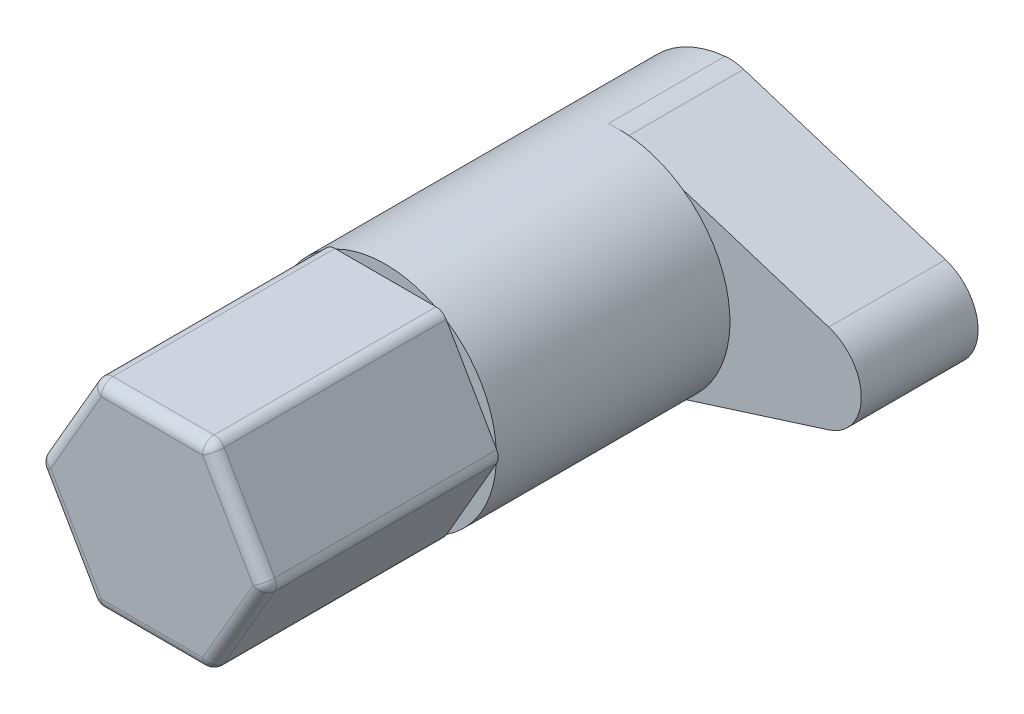
ISO-10303-21;
HEADER;
FILE_DESCRIPTION(('STEP AP214'),'2;1');
FILE_NAME('part.step','',(''),(''),'','','');
FILE_SCHEMA(('AUTOMOTIVE_DESIGN { 1 0 10303 214 1 1 1 1 }'));
ENDSEC;
DATA;
#1=APPLICATION_CONTEXT('core data for automotive mechanical design processes');
#2=APPLICATION_PROTOCOL_DEFINITION('international standard','automotive_design',2000,#1);
#3=PRODUCT_CONTEXT('',#1,'mechanical');
#4=PRODUCT('Part','Part','',(#3));
#5=PRODUCT_RELATED_PRODUCT_CATEGORY('part','',(#4));
#6=PRODUCT_DEFINITION_FORMATION('','',#4);
#7=PRODUCT_DEFINITION_CONTEXT('part definition',#1,'design');
#8=PRODUCT_DEFINITION('design','',#6,#7);
#9=PRODUCT_DEFINITION_SHAPE('','',#8);
#10=(LENGTH_UNIT() NAMED_UNIT(*) SI_UNIT(.MILLI.,.METRE.));
#11=(NAMED_UNIT(*) PLANE_ANGLE_UNIT() SI_UNIT($,.RADIAN.));
#12=(NAMED_UNIT(*) SI_UNIT($,.STERADIAN.) SOLID_ANGLE_UNIT());
#13=UNCERTAINTY_MEASURE_WITH_UNIT(LENGTH_MEASURE(1.E-05),#10,'distance_accuracy_value','');
#14=(GEOMETRIC_REPRESENTATION_CONTEXT(3) GLOBAL_UNCERTAINTY_ASSIGNED_CONTEXT((#13)) GLOBAL_UNIT_ASSIGNED_CONTEXT((#10,
#11,#12)) REPRESENTATION_CONTEXT('',''));
#15=CARTESIAN_POINT('',(0.,0.,0.));
#16=DIRECTION('',(0.,0.,1.));
#17=DIRECTION('',(1.,0.,0.));
#18=AXIS2_PLACEMENT_3D('',#15,#16,#17);
#19=CARTESIAN_POINT('',(0.,0.,-10.));
#20=DIRECTION('',(0.,0.,-1.));
#21=DIRECTION('',(-1.,0.,0.));
#22=AXIS2_PLACEMENT_3D('',#19,#20,#21);
#23=PLANE('',#22);
#24=DIRECTION('',(-0.953342225350744,-0.301891704694402,0.));
#25=VECTOR('',#24,1.);
#26=CARTESIAN_POINT('',(15.,0.,-10.));
#27=LINE('',#26,#25);
#28=CARTESIAN_POINT('',(2.73415804089876,-3.88418328704872,-10.));
#29=VERTEX_POINT('',#28);
#30=CARTESIAN_POINT('',(0.335962396600342,-4.64361190774323,-10.));
#31=VERTEX_POINT('',#30);
#32=EDGE_CURVE('E271',#29,#31,#27,.T.);
#33=ORIENTED_EDGE('',*,*,#32,.F.);
#34=CARTESIAN_POINT('',(0.,0.,-10.));
#35=DIRECTION('',(0.,0.,-1.));
#36=DIRECTION('',(-1.,0.,0.));
#37=AXIS2_PLACEMENT_3D('',#34,#35,#36);
#38=CIRCLE('',#37,4.75);
#39=CARTESIAN_POINT('',(-0.462599931180075,-4.72742015307209,-10.));
#40=VERTEX_POINT('',#39);
#41=EDGE_CURVE('E254',#29,#40,#38,.T.);
#42=ORIENTED_EDGE('',*,*,#41,.T.);
#43=CARTESIAN_POINT('',(-0.267821012788464,-2.73692745704174,-10.));
#44=DIRECTION('',(0.,0.,-1.));
#45=DIRECTION('',(-1.,0.,0.));
#46=AXIS2_PLACEMENT_3D('',#43,#44,#45);
#47=CIRCLE('',#46,2.);
#48=EDGE_CURVE('E11',#40,#31,#47,.F.);
#49=ORIENTED_EDGE('',*,*,#48,.T.);
#50=EDGE_LOOP('',(#33,#42,#49));
#51=FACE_BOUND('',#50,.T.);
#52=ADVANCED_FACE('F45',(#51),#23,.T.);
#53=CARTESIAN_POINT('',(0.,0.,0.));
#54=DIRECTION('',(0.,0.,1.));
#55=DIRECTION('',(1.,0.,0.));
#56=AXIS2_PLACEMENT_3D('',#53,#54,#55);
#57=PLANE('',#56);
#58=CARTESIAN_POINT('',(0.,0.,0.));
#59=DIRECTION('',(0.,0.,-1.));
#60=DIRECTION('',(-1.,0.,0.));
#61=AXIS2_PLACEMENT_3D('',#58,#59,#60);
#62=CIRCLE('',#61,4.75);
#63=CARTESIAN_POINT('',(-2.61994779430404,3.96211730708738,0.));
#64=VERTEX_POINT('',#63);
#65=CARTESIAN_POINT('',(-2.12132034355964,4.25,0.));
#66=VERTEX_POINT('',#65);
#67=EDGE_CURVE('E513',#64,#66,#62,.T.);
#68=ORIENTED_EDGE('',*,*,#67,.F.);
#69=DIRECTION('',(-0.5,-0.866025403784439,0.));
#70=VECTOR('',#69,1.);
#71=CARTESIAN_POINT('',(-2.45373864405591,4.25,0.));
#72=LINE('',#71,#70);
#73=CARTESIAN_POINT('',(-2.59807621135332,4.,0.));
#74=VERTEX_POINT('',#73);
#75=EDGE_CURVE('E305',#74,#64,#72,.T.);
#76=ORIENTED_EDGE('',*,*,#75,.F.);
#77=CARTESIAN_POINT('',(-2.1650635094611,3.75,0.));
#78=DIRECTION('',(0.,0.,1.));
#79=DIRECTION('',(1.,0.,0.));
#80=AXIS2_PLACEMENT_3D('',#77,#78,#79);
#81=CIRCLE('',#80,0.5);
#82=CARTESIAN_POINT('',(-2.1650635094611,4.25,0.));
#83=VERTEX_POINT('',#82);
#84=EDGE_CURVE('E390',#74,#83,#81,.F.);
#85=ORIENTED_EDGE('',*,*,#84,.T.);
#86=DIRECTION('',(-1.,0.,0.));
#87=VECTOR('',#86,1.);
#88=CARTESIAN_POINT('',(2.45373864405591,4.25,0.));
#89=LINE('',#88,#87);
#90=EDGE_CURVE('E297',#66,#83,#89,.T.);
#91=ORIENTED_EDGE('',*,*,#90,.F.);
#92=EDGE_LOOP('',(#68,#76,#85,#91));
#93=FACE_BOUND('',#92,.T.);
#94=ADVANCED_FACE('F588',(#93),#57,.F.);
#95=CARTESIAN_POINT('',(2.12132034355964,4.25,0.));
#96=VERTEX_POINT('',#95);
#97=CARTESIAN_POINT('',(2.61994779430404,3.96211730708738,0.));
#98=VERTEX_POINT('',#97);
#99=EDGE_CURVE('E516',#96,#98,#62,.T.);
#100=ORIENTED_EDGE('',*,*,#99,.F.);
#101=CARTESIAN_POINT('',(2.1650635094611,4.25,0.));
#102=VERTEX_POINT('',#101);
#103=EDGE_CURVE('E299',#102,#96,#89,.T.);
#104=ORIENTED_EDGE('',*,*,#103,.F.);
#105=CARTESIAN_POINT('',(2.1650635094611,3.75,0.));
#106=DIRECTION('',(0.,0.,1.));
#107=DIRECTION('',(1.,0.,0.));
#108=AXIS2_PLACEMENT_3D('',#105,#106,#107);
#109=CIRCLE('',#108,0.5);
#110=CARTESIAN_POINT('',(2.59807621135332,4.,0.));
#111=VERTEX_POINT('',#110);
#112=EDGE_CURVE('E394',#102,#111,#109,.F.);
#113=ORIENTED_EDGE('',*,*,#112,.T.);
#114=DIRECTION('',(-0.5,0.866025403784439,0.));
#115=VECTOR('',#114,1.);
#116=CARTESIAN_POINT('',(4.90747728811182,0.,0.));
#117=LINE('',#116,#115);
#118=EDGE_CURVE('E291',#98,#111,#117,.T.);
#119=ORIENTED_EDGE('',*,*,#118,.F.);
#120=EDGE_LOOP('',(#100,#104,#113,#119));
#121=FACE_BOUND('',#120,.T.);
#122=ADVANCED_FACE('F595',(#121),#57,.F.);
#123=CARTESIAN_POINT('',(4.74126813786369,0.28788269291262,0.));
#124=VERTEX_POINT('',#123);
#125=CARTESIAN_POINT('',(4.74126813786368,-0.287882692912619,0.));
#126=VERTEX_POINT('',#125);
#127=EDGE_CURVE('E519',#124,#126,#62,.T.);
#128=ORIENTED_EDGE('',*,*,#127,.F.);
#129=CARTESIAN_POINT('',(4.76313972081441,0.25,0.));
#130=VERTEX_POINT('',#129);
#131=EDGE_CURVE('E293',#130,#124,#117,.T.);
#132=ORIENTED_EDGE('',*,*,#131,.F.);
#133=CARTESIAN_POINT('',(4.3301270189222,0.,0.));
#134=DIRECTION('',(0.,0.,1.));
#135=DIRECTION('',(1.,0.,0.));
#136=AXIS2_PLACEMENT_3D('',#133,#134,#135);
#137=CIRCLE('',#136,0.5);
#138=CARTESIAN_POINT('',(4.76313972081441,-0.25,0.));
#139=VERTEX_POINT('',#138);
#140=EDGE_CURVE('E398',#130,#139,#137,.F.);
#141=ORIENTED_EDGE('',*,*,#140,.T.);
#142=DIRECTION('',(0.5,0.866025403784439,0.));
#143=VECTOR('',#142,1.);
#144=CARTESIAN_POINT('',(2.45373864405591,-4.25,0.));
#145=LINE('',#144,#143);
#146=EDGE_CURVE('E284',#126,#139,#145,.T.);
#147=ORIENTED_EDGE('',*,*,#146,.F.);
#148=EDGE_LOOP('',(#128,#132,#141,#147));
#149=FACE_BOUND('',#148,.T.);
#150=ADVANCED_FACE('F765',(#149),#57,.F.);
#151=CARTESIAN_POINT('',(2.61994779430405,-3.96211730708738,0.));
#152=VERTEX_POINT('',#151);
#153=CARTESIAN_POINT('',(2.12132034355964,-4.25,0.));
#154=VERTEX_POINT('',#153);
#155=EDGE_CURVE('E522',#152,#154,#62,.T.);
#156=ORIENTED_EDGE('',*,*,#155,.F.);
#157=CARTESIAN_POINT('',(2.59807621135332,-4.,0.));
#158=VERTEX_POINT('',#157);
#159=EDGE_CURVE('E287',#158,#152,#145,.T.);
#160=ORIENTED_EDGE('',*,*,#159,.F.);
#161=CARTESIAN_POINT('',(2.1650635094611,-3.75,0.));
#162=DIRECTION('',(0.,0.,1.));
#163=DIRECTION('',(1.,0.,0.));
#164=AXIS2_PLACEMENT_3D('',#161,#162,#163);
#165=CIRCLE('',#164,0.5);
#166=CARTESIAN_POINT('',(2.1650635094611,-4.25,0.));
#167=VERTEX_POINT('',#166);
#168=EDGE_CURVE('E402',#158,#167,#165,.F.);
#169=ORIENTED_EDGE('',*,*,#168,.T.);
#170=DIRECTION('',(1.,0.,0.));
#171=VECTOR('',#170,1.);
#172=CARTESIAN_POINT('',(-2.4537386440559,-4.25,0.));
#173=LINE('',#172,#171);
#174=EDGE_CURVE('E286',#154,#167,#173,.T.);
#175=ORIENTED_EDGE('',*,*,#174,.F.);
#176=EDGE_LOOP('',(#156,#160,#169,#175));
#177=FACE_BOUND('',#176,.T.);
#178=ADVANCED_FACE('F758',(#177),#57,.F.);
#179=CARTESIAN_POINT('',(-2.12132034355964,-4.25,0.));
#180=VERTEX_POINT('',#179);
#181=CARTESIAN_POINT('',(-2.61994779430404,-3.96211730708739,0.));
#182=VERTEX_POINT('',#181);
#183=EDGE_CURVE('E525',#180,#182,#62,.T.);
#184=ORIENTED_EDGE('',*,*,#183,.F.);
#185=CARTESIAN_POINT('',(-2.16506350946109,-4.25,0.));
#186=VERTEX_POINT('',#185);
#187=EDGE_CURVE('E280',#186,#180,#173,.T.);
#188=ORIENTED_EDGE('',*,*,#187,.F.);
#189=CARTESIAN_POINT('',(-2.16506350946109,-3.75,0.));
#190=DIRECTION('',(0.,0.,1.));
#191=DIRECTION('',(1.,0.,0.));
#192=AXIS2_PLACEMENT_3D('',#189,#190,#191);
#193=CIRCLE('',#192,0.5);
#194=CARTESIAN_POINT('',(-2.59807621135331,-4.,0.));
#195=VERTEX_POINT('',#194);
#196=EDGE_CURVE('E410',#186,#195,#193,.F.);
#197=ORIENTED_EDGE('',*,*,#196,.T.);
#198=DIRECTION('',(0.5,-0.866025403784438,0.));
#199=VECTOR('',#198,1.);
#200=CARTESIAN_POINT('',(-4.90747728811182,0.,0.));
#201=LINE('',#200,#199);
#202=EDGE_CURVE('E309',#182,#195,#201,.T.);
#203=ORIENTED_EDGE('',*,*,#202,.F.);
#204=EDGE_LOOP('',(#184,#188,#197,#203));
#205=FACE_BOUND('',#204,.T.);
#206=ADVANCED_FACE('F624',(#205),#57,.F.);
#207=CARTESIAN_POINT('',(-2.4537386440559,-4.25,10.));
#208=DIRECTION('',(0.,1.,0.));
#209=DIRECTION('',(-1.,0.,0.));
#210=AXIS2_PLACEMENT_3D('',#207,#208,#209);
#211=PLANE('',#210);
#212=DIRECTION('',(1.,0.,0.));
#213=VECTOR('',#212,1.);
#214=CARTESIAN_POINT('',(-2.4537386440559,-4.25,9.5));
#215=LINE('',#214,#213);
#216=CARTESIAN_POINT('',(2.1650635094611,-4.25,9.5));
#217=VERTEX_POINT('',#216);
#218=CARTESIAN_POINT('',(-2.16506350946109,-4.25,9.5));
#219=VERTEX_POINT('',#218);
#220=EDGE_CURVE('E384',#217,#219,#215,.F.);
#221=ORIENTED_EDGE('',*,*,#220,.T.);
#222=DIRECTION('',(0.,0.,-1.));
#223=VECTOR('',#222,1.);
#224=CARTESIAN_POINT('',(-2.16506350946109,-4.25,10.));
#225=LINE('',#224,#223);
#226=EDGE_CURVE('E387',#219,#186,#225,.T.);
#227=ORIENTED_EDGE('',*,*,#226,.T.);
#228=ORIENTED_EDGE('',*,*,#187,.T.);
#229=EDGE_CURVE('E285',#180,#154,#173,.T.);
#230=ORIENTED_EDGE('',*,*,#229,.T.);
#231=ORIENTED_EDGE('',*,*,#174,.T.);
#232=DIRECTION('',(0.,0.,-1.));
#233=VECTOR('',#232,1.);
#234=CARTESIAN_POINT('',(2.1650635094611,-4.25,10.));
#235=LINE('',#234,#233);
#236=EDGE_CURVE('E381',#167,#217,#235,.F.);
#237=ORIENTED_EDGE('',*,*,#236,.T.);
#238=EDGE_LOOP('',(#221,#227,#228,#230,#231,#237));
#239=FACE_BOUND('',#238,.T.);
#240=ADVANCED_FACE('F643',(#239),#211,.F.);
#241=CARTESIAN_POINT('',(2.45373864405591,-4.25,10.));
#242=DIRECTION('',(-0.866025403784439,0.5,0.));
#243=DIRECTION('',(-0.5,-0.866025403784439,0.));
#244=AXIS2_PLACEMENT_3D('',#241,#242,#243);
#245=PLANE('',#244);
#246=DIRECTION('',(0.5,0.866025403784439,0.));
#247=VECTOR('',#246,1.);
#248=CARTESIAN_POINT('',(2.45373864405591,-4.25,9.5));
#249=LINE('',#248,#247);
#250=CARTESIAN_POINT('',(4.76313972081442,-0.25,9.5));
#251=VERTEX_POINT('',#250);
#252=CARTESIAN_POINT('',(2.59807621135332,-4.,9.5));
#253=VERTEX_POINT('',#252);
#254=EDGE_CURVE('E375',#251,#253,#249,.F.);
#255=ORIENTED_EDGE('',*,*,#254,.T.);
#256=DIRECTION('',(0.,0.,-1.));
#257=VECTOR('',#256,1.);
#258=CARTESIAN_POINT('',(2.59807621135332,-4.,10.));
#259=LINE('',#258,#257);
#260=EDGE_CURVE('E378',#253,#158,#259,.T.);
#261=ORIENTED_EDGE('',*,*,#260,.T.);
#262=ORIENTED_EDGE('',*,*,#159,.T.);
#263=EDGE_CURVE('E292',#152,#126,#145,.T.);
#264=ORIENTED_EDGE('',*,*,#263,.T.);
#265=ORIENTED_EDGE('',*,*,#146,.T.);
#266=DIRECTION('',(0.,0.,-1.));
#267=VECTOR('',#266,1.);
#268=CARTESIAN_POINT('',(4.76313972081442,-0.249999999999999,10.));
#269=LINE('',#268,#267);
#270=EDGE_CURVE('E372',#139,#251,#269,.F.);
#271=ORIENTED_EDGE('',*,*,#270,.T.);
#272=EDGE_LOOP('',(#255,#261,#262,#264,#265,#271));
#273=FACE_BOUND('',#272,.T.);
#274=ADVANCED_FACE('F639',(#273),#245,.F.);
#275=CARTESIAN_POINT('',(4.90747728811182,0.,10.));
#276=DIRECTION('',(-0.866025403784438,-0.5,0.));
#277=DIRECTION('',(0.5,-0.866025403784439,0.));
#278=AXIS2_PLACEMENT_3D('',#275,#276,#277);
#279=PLANE('',#278);
#280=DIRECTION('',(-0.5,0.866025403784439,0.));
#281=VECTOR('',#280,1.);
#282=CARTESIAN_POINT('',(4.90747728811182,0.,9.5));
#283=LINE('',#282,#281);
#284=CARTESIAN_POINT('',(2.59807621135332,4.,9.5));
#285=VERTEX_POINT('',#284);
#286=CARTESIAN_POINT('',(4.76313972081441,0.25,9.5));
#287=VERTEX_POINT('',#286);
#288=EDGE_CURVE('E366',#285,#287,#283,.F.);
#289=ORIENTED_EDGE('',*,*,#288,.T.);
#290=DIRECTION('',(0.,0.,-1.));
#291=VECTOR('',#290,1.);
#292=CARTESIAN_POINT('',(4.76313972081441,0.25,10.));
#293=LINE('',#292,#291);
#294=EDGE_CURVE('E369',#287,#130,#293,.T.);
#295=ORIENTED_EDGE('',*,*,#294,.T.);
#296=ORIENTED_EDGE('',*,*,#131,.T.);
#297=EDGE_CURVE('E298',#124,#98,#117,.T.);
#298=ORIENTED_EDGE('',*,*,#297,.T.);
#299=ORIENTED_EDGE('',*,*,#118,.T.);
#300=DIRECTION('',(0.,0.,-1.));
#301=VECTOR('',#300,1.);
#302=CARTESIAN_POINT('',(2.59807621135332,4.,10.));
#303=LINE('',#302,#301);
#304=EDGE_CURVE('E363',#111,#285,#303,.F.);
#305=ORIENTED_EDGE('',*,*,#304,.T.);
#306=EDGE_LOOP('',(#289,#295,#296,#298,#299,#305));
#307=FACE_BOUND('',#306,.T.);
#308=ADVANCED_FACE('F635',(#307),#279,.F.);
#309=CARTESIAN_POINT('',(2.45373864405591,4.25,10.));
#310=DIRECTION('',(0.,-1.,0.));
#311=DIRECTION('',(0.,0.,-1.));
#312=AXIS2_PLACEMENT_3D('',#309,#310,#311);
#313=PLANE('',#312);
#314=DIRECTION('',(-1.,0.,0.));
#315=VECTOR('',#314,1.);
#316=CARTESIAN_POINT('',(2.45373864405591,4.25,9.5));
#317=LINE('',#316,#315);
#318=CARTESIAN_POINT('',(-2.1650635094611,4.25,9.5));
#319=VERTEX_POINT('',#318);
#320=CARTESIAN_POINT('',(2.1650635094611,4.25,9.5));
#321=VERTEX_POINT('',#320);
#322=EDGE_CURVE('E357',#319,#321,#317,.F.);
#323=ORIENTED_EDGE('',*,*,#322,.T.);
#324=DIRECTION('',(0.,0.,-1.));
#325=VECTOR('',#324,1.);
#326=CARTESIAN_POINT('',(2.1650635094611,4.25,10.));
#327=LINE('',#326,#325);
#328=EDGE_CURVE('E360',#321,#102,#327,.T.);
#329=ORIENTED_EDGE('',*,*,#328,.T.);
#330=ORIENTED_EDGE('',*,*,#103,.T.);
#331=EDGE_CURVE('E304',#96,#66,#89,.T.);
#332=ORIENTED_EDGE('',*,*,#331,.T.);
#333=ORIENTED_EDGE('',*,*,#90,.T.);
#334=DIRECTION('',(0.,0.,-1.));
#335=VECTOR('',#334,1.);
#336=CARTESIAN_POINT('',(-2.1650635094611,4.25,10.));
#337=LINE('',#336,#335);
#338=EDGE_CURVE('E354',#83,#319,#337,.F.);
#339=ORIENTED_EDGE('',*,*,#338,.T.);
#340=EDGE_LOOP('',(#323,#329,#330,#332,#333,#339));
#341=FACE_BOUND('',#340,.T.);
#342=ADVANCED_FACE('F631',(#341),#313,.F.);
#343=CARTESIAN_POINT('',(-2.45373864405591,4.25,10.));
#344=DIRECTION('',(0.866025403784439,-0.5,0.));
#345=DIRECTION('',(0.5,0.866025403784439,0.));
#346=AXIS2_PLACEMENT_3D('',#343,#344,#345);
#347=PLANE('',#346);
#348=ORIENTED_EDGE('',*,*,#75,.T.);
#349=CARTESIAN_POINT('',(-4.74126813786369,0.287882692912615,0.));
#350=VERTEX_POINT('',#349);
#351=EDGE_CURVE('E310',#64,#350,#72,.T.);
#352=ORIENTED_EDGE('',*,*,#351,.T.);
#353=CARTESIAN_POINT('',(-4.76313972081441,0.25,0.));
#354=VERTEX_POINT('',#353);
#355=EDGE_CURVE('E303',#350,#354,#72,.T.);
#356=ORIENTED_EDGE('',*,*,#355,.T.);
#357=DIRECTION('',(0.,0.,-1.));
#358=VECTOR('',#357,1.);
#359=CARTESIAN_POINT('',(-4.76313972081441,0.25,10.));
#360=LINE('',#359,#358);
#361=CARTESIAN_POINT('',(-4.76313972081441,0.25,9.5));
#362=VERTEX_POINT('',#361);
#363=EDGE_CURVE('E351',#354,#362,#360,.F.);
#364=ORIENTED_EDGE('',*,*,#363,.T.);
#365=DIRECTION('',(-0.5,-0.866025403784439,0.));
#366=VECTOR('',#365,1.);
#367=CARTESIAN_POINT('',(-2.45373864405591,4.25,9.5));
#368=LINE('',#367,#366);
#369=CARTESIAN_POINT('',(-2.59807621135332,4.,9.5));
#370=VERTEX_POINT('',#369);
#371=EDGE_CURVE('E348',#362,#370,#368,.F.);
#372=ORIENTED_EDGE('',*,*,#371,.T.);
#373=DIRECTION('',(0.,0.,-1.));
#374=VECTOR('',#373,1.);
#375=CARTESIAN_POINT('',(-2.59807621135332,4.,10.));
#376=LINE('',#375,#374);
#377=EDGE_CURVE('E345',#370,#74,#376,.T.);
#378=ORIENTED_EDGE('',*,*,#377,.T.);
#379=EDGE_LOOP('',(#348,#352,#356,#364,#372,#378));
#380=FACE_BOUND('',#379,.T.);
#381=ADVANCED_FACE('F627',(#380),#347,.F.);
#382=CARTESIAN_POINT('',(-4.90747728811182,0.,10.));
#383=DIRECTION('',(0.866025403784438,0.5,0.));
#384=DIRECTION('',(-0.5,0.866025403784438,0.));
#385=AXIS2_PLACEMENT_3D('',#382,#383,#384);
#386=PLANE('',#385);
#387=CARTESIAN_POINT('',(-4.76313972081441,-0.25,0.));
#388=VERTEX_POINT('',#387);
#389=CARTESIAN_POINT('',(-4.74126813786369,-0.287882692912616,0.));
#390=VERTEX_POINT('',#389);
#391=EDGE_CURVE('E311',#388,#390,#201,.T.);
#392=ORIENTED_EDGE('',*,*,#391,.T.);
#393=EDGE_CURVE('E316',#390,#182,#201,.T.);
#394=ORIENTED_EDGE('',*,*,#393,.T.);
#395=ORIENTED_EDGE('',*,*,#202,.T.);
#396=DIRECTION('',(0.,0.,-1.));
#397=VECTOR('',#396,1.);
#398=CARTESIAN_POINT('',(-2.59807621135331,-4.,10.));
#399=LINE('',#398,#397);
#400=CARTESIAN_POINT('',(-2.59807621135331,-4.,9.5));
#401=VERTEX_POINT('',#400);
#402=EDGE_CURVE('E342',#195,#401,#399,.F.);
#403=ORIENTED_EDGE('',*,*,#402,.T.);
#404=DIRECTION('',(0.5,-0.866025403784438,0.));
#405=VECTOR('',#404,1.);
#406=CARTESIAN_POINT('',(-4.90747728811182,0.,9.5));
#407=LINE('',#406,#405);
#408=CARTESIAN_POINT('',(-4.76313972081441,-0.25,9.5));
#409=VERTEX_POINT('',#408);
#410=EDGE_CURVE('E338',#401,#409,#407,.F.);
#411=ORIENTED_EDGE('',*,*,#410,.T.);
#412=DIRECTION('',(0.,0.,-1.));
#413=VECTOR('',#412,1.);
#414=CARTESIAN_POINT('',(-4.76313972081441,-0.25,10.));
#415=LINE('',#414,#413);
#416=EDGE_CURVE('E335',#409,#388,#415,.T.);
#417=ORIENTED_EDGE('',*,*,#416,.T.);
#418=EDGE_LOOP('',(#392,#394,#395,#403,#411,#417));
#419=FACE_BOUND('',#418,.T.);
#420=ADVANCED_FACE('F618',(#419),#386,.F.);
#421=CARTESIAN_POINT('',(0.,0.,10.));
#422=DIRECTION('',(0.,0.,1.));
#423=DIRECTION('',(1.,0.,0.));
#424=AXIS2_PLACEMENT_3D('',#421,#422,#423);
#425=PLANE('',#424);
#426=DIRECTION('',(-0.5,-0.866025403784439,0.));
#427=VECTOR('',#426,1.);
#428=CARTESIAN_POINT('',(-4.4744645862196,-0.250000000000001,10.));
#429=LINE('',#428,#427);
#430=CARTESIAN_POINT('',(-2.1650635094611,3.75,10.));
#431=VERTEX_POINT('',#430);
#432=CARTESIAN_POINT('',(-4.33012701892219,0.,10.));
#433=VERTEX_POINT('',#432);
#434=EDGE_CURVE('E328',#431,#433,#429,.T.);
#435=ORIENTED_EDGE('',*,*,#434,.T.);
#436=DIRECTION('',(0.5,-0.866025403784438,0.));
#437=VECTOR('',#436,1.);
#438=CARTESIAN_POINT('',(-2.02072594216369,-4.,10.));
#439=LINE('',#438,#437);
#440=CARTESIAN_POINT('',(-2.16506350946109,-3.75,10.));
#441=VERTEX_POINT('',#440);
#442=EDGE_CURVE('E331',#433,#441,#439,.T.);
#443=ORIENTED_EDGE('',*,*,#442,.T.);
#444=DIRECTION('',(1.,0.,0.));
#445=VECTOR('',#444,1.);
#446=CARTESIAN_POINT('',(2.45373864405591,-3.75,10.));
#447=LINE('',#446,#445);
#448=CARTESIAN_POINT('',(2.1650635094611,-3.75,10.));
#449=VERTEX_POINT('',#448);
#450=EDGE_CURVE('E315',#441,#449,#447,.T.);
#451=ORIENTED_EDGE('',*,*,#450,.T.);
#452=DIRECTION('',(0.5,0.866025403784439,0.));
#453=VECTOR('',#452,1.);
#454=CARTESIAN_POINT('',(4.4744645862196,0.250000000000001,10.));
#455=LINE('',#454,#453);
#456=CARTESIAN_POINT('',(4.3301270189222,0.,10.));
#457=VERTEX_POINT('',#456);
#458=EDGE_CURVE('E319',#449,#457,#455,.T.);
#459=ORIENTED_EDGE('',*,*,#458,.T.);
#460=DIRECTION('',(-0.5,0.866025403784439,0.));
#461=VECTOR('',#460,1.);
#462=CARTESIAN_POINT('',(2.02072594216369,4.,10.));
#463=LINE('',#462,#461);
#464=CARTESIAN_POINT('',(2.1650635094611,3.75,10.));
#465=VERTEX_POINT('',#464);
#466=EDGE_CURVE('E322',#457,#465,#463,.T.);
#467=ORIENTED_EDGE('',*,*,#466,.T.);
#468=DIRECTION('',(-1.,0.,0.));
#469=VECTOR('',#468,1.);
#470=CARTESIAN_POINT('',(-2.45373864405591,3.75,10.));
#471=LINE('',#470,#469);
#472=EDGE_CURVE('E325',#465,#431,#471,.T.);
#473=ORIENTED_EDGE('',*,*,#472,.T.);
#474=EDGE_LOOP('',(#435,#443,#451,#459,#467,#473));
#475=FACE_BOUND('',#474,.T.);
#476=ADVANCED_FACE('F616',(#475),#425,.T.);
#477=EDGE_CURVE('E279',#390,#350,#62,.T.);
#478=ORIENTED_EDGE('',*,*,#477,.F.);
#479=ORIENTED_EDGE('',*,*,#391,.F.);
#480=CARTESIAN_POINT('',(-4.33012701892219,0.,0.));
#481=DIRECTION('',(0.,0.,1.));
#482=DIRECTION('',(1.,0.,0.));
#483=AXIS2_PLACEMENT_3D('',#480,#481,#482);
#484=CIRCLE('',#483,0.5);
#485=EDGE_CURVE('E406',#388,#354,#484,.F.);
#486=ORIENTED_EDGE('',*,*,#485,.T.);
#487=ORIENTED_EDGE('',*,*,#355,.F.);
#488=EDGE_LOOP('',(#478,#479,#486,#487));
#489=FACE_BOUND('',#488,.T.);
#490=ADVANCED_FACE('F598',(#489),#57,.F.);
#491=CARTESIAN_POINT('',(2.1650635094611,3.75,10.));
#492=DIRECTION('',(0.,0.,-1.));
#493=DIRECTION('',(-1.,0.,0.));
#494=AXIS2_PLACEMENT_3D('',#491,#492,#493);
#495=CYLINDRICAL_SURFACE('',#494,0.5);
#496=ORIENTED_EDGE('',*,*,#112,.F.);
#497=ORIENTED_EDGE('',*,*,#328,.F.);
#498=CARTESIAN_POINT('',(2.1650635094611,3.75,9.5));
#499=DIRECTION('',(0.,0.,1.));
#500=DIRECTION('',(1.,0.,0.));
#501=AXIS2_PLACEMENT_3D('',#498,#499,#500);
#502=CIRCLE('',#501,0.5);
#503=EDGE_CURVE('E479',#285,#321,#502,.T.);
#504=ORIENTED_EDGE('',*,*,#503,.F.);
#505=ORIENTED_EDGE('',*,*,#304,.F.);
#506=EDGE_LOOP('',(#496,#497,#504,#505));
#507=FACE_BOUND('',#506,.T.);
#508=ADVANCED_FACE('F622',(#507),#495,.T.);
#509=CARTESIAN_POINT('',(3.24759526419165,1.875,9.5));
#510=DIRECTION('',(0.5,-0.866025403784439,0.));
#511=DIRECTION('',(0.866025403784438,0.5,0.));
#512=AXIS2_PLACEMENT_3D('',#509,#510,#511);
#513=CYLINDRICAL_SURFACE('',#512,0.5);
#514=CARTESIAN_POINT('',(4.33012701892219,0.,9.5));
#515=DIRECTION('',(0.5,-0.866025403784439,0.));
#516=DIRECTION('',(0.866025403784439,0.5,0.));
#517=AXIS2_PLACEMENT_3D('',#514,#515,#516);
#518=CIRCLE('',#517,0.5);
#519=EDGE_CURVE('E471',#287,#457,#518,.T.);
#520=ORIENTED_EDGE('',*,*,#519,.F.);
#521=ORIENTED_EDGE('',*,*,#288,.F.);
#522=CARTESIAN_POINT('',(2.1650635094611,3.75,9.5));
#523=DIRECTION('',(-0.5,0.866025403784439,0.));
#524=DIRECTION('',(-0.866025403784439,-0.5,0.));
#525=AXIS2_PLACEMENT_3D('',#522,#523,#524);
#526=CIRCLE('',#525,0.5);
#527=EDGE_CURVE('E475',#465,#285,#526,.T.);
#528=ORIENTED_EDGE('',*,*,#527,.F.);
#529=ORIENTED_EDGE('',*,*,#466,.F.);
#530=EDGE_LOOP('',(#520,#521,#528,#529));
#531=FACE_BOUND('',#530,.T.);
#532=ADVANCED_FACE('F711',(#531),#513,.T.);
#533=CARTESIAN_POINT('',(4.3301270189222,0.,10.));
#534=DIRECTION('',(0.,0.,-1.));
#535=DIRECTION('',(-1.,0.,0.));
#536=AXIS2_PLACEMENT_3D('',#533,#534,#535);
#537=CYLINDRICAL_SURFACE('',#536,0.5);
#538=ORIENTED_EDGE('',*,*,#140,.F.);
#539=ORIENTED_EDGE('',*,*,#294,.F.);
#540=CARTESIAN_POINT('',(4.3301270189222,0.,9.5));
#541=DIRECTION('',(0.,0.,1.));
#542=DIRECTION('',(1.,0.,0.));
#543=AXIS2_PLACEMENT_3D('',#540,#541,#542);
#544=CIRCLE('',#543,0.5);
#545=EDGE_CURVE('E467',#251,#287,#544,.T.);
#546=ORIENTED_EDGE('',*,*,#545,.F.);
#547=ORIENTED_EDGE('',*,*,#270,.F.);
#548=EDGE_LOOP('',(#538,#539,#546,#547));
#549=FACE_BOUND('',#548,.T.);
#550=ADVANCED_FACE('F707',(#549),#537,.T.);
#551=CARTESIAN_POINT('',(2.1650635094611,3.75,9.5));
#552=DIRECTION('',(0.,0.,1.));
#553=DIRECTION('',(1.,0.,0.));
#554=AXIS2_PLACEMENT_3D('',#551,#552,#553);
#555=SPHERICAL_SURFACE('',#554,0.5);
#556=ORIENTED_EDGE('',*,*,#527,.T.);
#557=ORIENTED_EDGE('',*,*,#503,.T.);
#558=CARTESIAN_POINT('',(2.1650635094611,3.75,9.5));
#559=DIRECTION('',(1.,0.,0.));
#560=DIRECTION('',(0.,0.,-1.));
#561=AXIS2_PLACEMENT_3D('',#558,#559,#560);
#562=CIRCLE('',#561,0.5);
#563=EDGE_CURVE('E463',#465,#321,#562,.F.);
#564=ORIENTED_EDGE('',*,*,#563,.F.);
#565=EDGE_LOOP('',(#556,#557,#564));
#566=FACE_BOUND('',#565,.T.);
#567=ADVANCED_FACE('F703',(#566),#555,.T.);
#568=CARTESIAN_POINT('',(4.3301270189222,0.,9.5));
#569=DIRECTION('',(0.,0.,1.));
#570=DIRECTION('',(0.,-1.,0.));
#571=AXIS2_PLACEMENT_3D('',#568,#569,#570);
#572=SPHERICAL_SURFACE('',#571,0.5);
#573=ORIENTED_EDGE('',*,*,#545,.T.);
#574=ORIENTED_EDGE('',*,*,#519,.T.);
#575=CARTESIAN_POINT('',(4.3301270189222,0.,9.5));
#576=DIRECTION('',(0.5,0.866025403784439,0.));
#577=DIRECTION('',(-0.866025403784439,0.5,0.));
#578=AXIS2_PLACEMENT_3D('',#575,#576,#577);
#579=CIRCLE('',#578,0.5);
#580=EDGE_CURVE('E459',#251,#457,#579,.F.);
#581=ORIENTED_EDGE('',*,*,#580,.F.);
#582=EDGE_LOOP('',(#573,#574,#581));
#583=FACE_BOUND('',#582,.T.);
#584=ADVANCED_FACE('F699',(#583),#572,.T.);
#585=CARTESIAN_POINT('',(-2.1650635094611,3.75,10.));
#586=DIRECTION('',(0.,0.,-1.));
#587=DIRECTION('',(-1.,0.,0.));
#588=AXIS2_PLACEMENT_3D('',#585,#586,#587);
#589=CYLINDRICAL_SURFACE('',#588,0.5);
#590=ORIENTED_EDGE('',*,*,#84,.F.);
#591=ORIENTED_EDGE('',*,*,#377,.F.);
#592=CARTESIAN_POINT('',(-2.1650635094611,3.75,9.5));
#593=DIRECTION('',(0.,0.,1.));
#594=DIRECTION('',(1.,0.,0.));
#595=AXIS2_PLACEMENT_3D('',#592,#593,#594);
#596=CIRCLE('',#595,0.5);
#597=EDGE_CURVE('E455',#319,#370,#596,.T.);
#598=ORIENTED_EDGE('',*,*,#597,.F.);
#599=ORIENTED_EDGE('',*,*,#338,.F.);
#600=EDGE_LOOP('',(#590,#591,#598,#599));
#601=FACE_BOUND('',#600,.T.);
#602=ADVANCED_FACE('F695',(#601),#589,.T.);
#603=CARTESIAN_POINT('',(0.,3.75,9.5));
#604=DIRECTION('',(1.,0.,0.));
#605=DIRECTION('',(0.,0.,-1.));
#606=AXIS2_PLACEMENT_3D('',#603,#604,#605);
#607=CYLINDRICAL_SURFACE('',#606,0.5);
#608=ORIENTED_EDGE('',*,*,#563,.T.);
#609=ORIENTED_EDGE('',*,*,#322,.F.);
#610=CARTESIAN_POINT('',(-2.1650635094611,3.75,9.5));
#611=DIRECTION('',(-1.,0.,0.));
#612=DIRECTION('',(0.,0.,1.));
#613=AXIS2_PLACEMENT_3D('',#610,#611,#612);
#614=CIRCLE('',#613,0.5);
#615=EDGE_CURVE('E451',#431,#319,#614,.T.);
#616=ORIENTED_EDGE('',*,*,#615,.F.);
#617=ORIENTED_EDGE('',*,*,#472,.F.);
#618=EDGE_LOOP('',(#608,#609,#616,#617));
#619=FACE_BOUND('',#618,.T.);
#620=ADVANCED_FACE('F691',(#619),#607,.T.);
#621=CARTESIAN_POINT('',(3.24759526419165,-1.875,9.5));
#622=DIRECTION('',(-0.5,-0.866025403784439,0.));
#623=DIRECTION('',(0.866025403784439,-0.5,0.));
#624=AXIS2_PLACEMENT_3D('',#621,#622,#623);
#625=CYLINDRICAL_SURFACE('',#624,0.5);
#626=ORIENTED_EDGE('',*,*,#580,.T.);
#627=ORIENTED_EDGE('',*,*,#458,.F.);
#628=CARTESIAN_POINT('',(2.1650635094611,-3.75,9.5));
#629=DIRECTION('',(-0.500000000000001,-0.866025403784438,0.));
#630=DIRECTION('',(0.866025403784438,-0.500000000000001,0.));
#631=AXIS2_PLACEMENT_3D('',#628,#629,#630);
#632=CIRCLE('',#631,0.5);
#633=EDGE_CURVE('E447',#253,#449,#632,.T.);
#634=ORIENTED_EDGE('',*,*,#633,.F.);
#635=ORIENTED_EDGE('',*,*,#254,.F.);
#636=EDGE_LOOP('',(#626,#627,#634,#635));
#637=FACE_BOUND('',#636,.T.);
#638=ADVANCED_FACE('F687',(#637),#625,.T.);
#639=CARTESIAN_POINT('',(2.1650635094611,-3.75,10.));
#640=DIRECTION('',(0.,0.,-1.));
#641=DIRECTION('',(-1.,0.,0.));
#642=AXIS2_PLACEMENT_3D('',#639,#640,#641);
#643=CYLINDRICAL_SURFACE('',#642,0.5);
#644=ORIENTED_EDGE('',*,*,#168,.F.);
#645=ORIENTED_EDGE('',*,*,#260,.F.);
#646=CARTESIAN_POINT('',(2.1650635094611,-3.75,9.5));
#647=DIRECTION('',(0.,0.,1.));
#648=DIRECTION('',(1.,0.,0.));
#649=AXIS2_PLACEMENT_3D('',#646,#647,#648);
#650=CIRCLE('',#649,0.5);
#651=EDGE_CURVE('E443',#217,#253,#650,.T.);
#652=ORIENTED_EDGE('',*,*,#651,.F.);
#653=ORIENTED_EDGE('',*,*,#236,.F.);
#654=EDGE_LOOP('',(#644,#645,#652,#653));
#655=FACE_BOUND('',#654,.T.);
#656=ADVANCED_FACE('F683',(#655),#643,.T.);
#657=CARTESIAN_POINT('',(-2.1650635094611,3.75,9.5));
#658=DIRECTION('',(0.,0.,1.));
#659=DIRECTION('',(1.,0.,0.));
#660=AXIS2_PLACEMENT_3D('',#657,#658,#659);
#661=SPHERICAL_SURFACE('',#660,0.5);
#662=ORIENTED_EDGE('',*,*,#615,.T.);
#663=ORIENTED_EDGE('',*,*,#597,.T.);
#664=CARTESIAN_POINT('',(-2.1650635094611,3.75,9.5));
#665=DIRECTION('',(0.500000000000001,0.866025403784438,0.));
#666=DIRECTION('',(-0.866025403784438,0.500000000000001,0.));
#667=AXIS2_PLACEMENT_3D('',#664,#665,#666);
#668=CIRCLE('',#667,0.5);
#669=EDGE_CURVE('E439',#431,#370,#668,.F.);
#670=ORIENTED_EDGE('',*,*,#669,.F.);
#671=EDGE_LOOP('',(#662,#663,#670));
#672=FACE_BOUND('',#671,.T.);
#673=ADVANCED_FACE('F679',(#672),#661,.T.);
#674=CARTESIAN_POINT('',(2.1650635094611,-3.75,9.5));
#675=DIRECTION('',(0.,0.,1.));
#676=DIRECTION('',(1.,0.,0.));
#677=AXIS2_PLACEMENT_3D('',#674,#675,#676);
#678=SPHERICAL_SURFACE('',#677,0.5);
#679=ORIENTED_EDGE('',*,*,#651,.T.);
#680=ORIENTED_EDGE('',*,*,#633,.T.);
#681=CARTESIAN_POINT('',(2.1650635094611,-3.75,9.5));
#682=DIRECTION('',(1.,0.,0.));
#683=DIRECTION('',(0.,1.,0.));
#684=AXIS2_PLACEMENT_3D('',#681,#682,#683);
#685=CIRCLE('',#684,0.5);
#686=EDGE_CURVE('E435',#217,#449,#685,.F.);
#687=ORIENTED_EDGE('',*,*,#686,.F.);
#688=EDGE_LOOP('',(#679,#680,#687));
#689=FACE_BOUND('',#688,.T.);
#690=ADVANCED_FACE('F675',(#689),#678,.T.);
#691=CARTESIAN_POINT('',(-4.33012701892219,0.,10.));
#692=DIRECTION('',(0.,0.,-1.));
#693=DIRECTION('',(-1.,0.,0.));
#694=AXIS2_PLACEMENT_3D('',#691,#692,#693);
#695=CYLINDRICAL_SURFACE('',#694,0.5);
#696=ORIENTED_EDGE('',*,*,#485,.F.);
#697=ORIENTED_EDGE('',*,*,#416,.F.);
#698=CARTESIAN_POINT('',(-4.33012701892219,0.,9.5));
#699=DIRECTION('',(0.,0.,1.));
#700=DIRECTION('',(1.,0.,0.));
#701=AXIS2_PLACEMENT_3D('',#698,#699,#700);
#702=CIRCLE('',#701,0.5);
#703=EDGE_CURVE('E431',#362,#409,#702,.T.);
#704=ORIENTED_EDGE('',*,*,#703,.F.);
#705=ORIENTED_EDGE('',*,*,#363,.F.);
#706=EDGE_LOOP('',(#696,#697,#704,#705));
#707=FACE_BOUND('',#706,.T.);
#708=ADVANCED_FACE('F671',(#707),#695,.T.);
#709=CARTESIAN_POINT('',(-3.24759526419164,1.875,9.5));
#710=DIRECTION('',(0.5,0.866025403784439,0.));
#711=DIRECTION('',(-0.866025403784439,0.5,0.));
#712=AXIS2_PLACEMENT_3D('',#709,#710,#711);
#713=CYLINDRICAL_SURFACE('',#712,0.5);
#714=ORIENTED_EDGE('',*,*,#669,.T.);
#715=ORIENTED_EDGE('',*,*,#371,.F.);
#716=CARTESIAN_POINT('',(-4.33012701892219,0.,9.5));
#717=DIRECTION('',(-0.500000000000001,-0.866025403784438,0.));
#718=DIRECTION('',(0.866025403784438,-0.500000000000001,0.));
#719=AXIS2_PLACEMENT_3D('',#716,#717,#718);
#720=CIRCLE('',#719,0.5);
#721=EDGE_CURVE('E427',#433,#362,#720,.T.);
#722=ORIENTED_EDGE('',*,*,#721,.F.);
#723=ORIENTED_EDGE('',*,*,#434,.F.);
#724=EDGE_LOOP('',(#714,#715,#722,#723));
#725=FACE_BOUND('',#724,.T.);
#726=ADVANCED_FACE('F667',(#725),#713,.T.);
#727=CARTESIAN_POINT('',(0.,-3.75,9.5));
#728=DIRECTION('',(-1.,0.,0.));
#729=DIRECTION('',(0.,-1.,0.));
#730=AXIS2_PLACEMENT_3D('',#727,#728,#729);
#731=CYLINDRICAL_SURFACE('',#730,0.5);
#732=ORIENTED_EDGE('',*,*,#686,.T.);
#733=ORIENTED_EDGE('',*,*,#450,.F.);
#734=CARTESIAN_POINT('',(-2.16506350946109,-3.75,9.5));
#735=DIRECTION('',(-1.,0.,0.));
#736=DIRECTION('',(0.,0.,1.));
#737=AXIS2_PLACEMENT_3D('',#734,#735,#736);
#738=CIRCLE('',#737,0.5);
#739=EDGE_CURVE('E423',#219,#441,#738,.T.);
#740=ORIENTED_EDGE('',*,*,#739,.F.);
#741=ORIENTED_EDGE('',*,*,#220,.F.);
#742=EDGE_LOOP('',(#732,#733,#740,#741));
#743=FACE_BOUND('',#742,.T.);
#744=ADVANCED_FACE('F663',(#743),#731,.T.);
#745=CARTESIAN_POINT('',(-2.16506350946109,-3.75,10.));
#746=DIRECTION('',(0.,0.,-1.));
#747=DIRECTION('',(-1.,0.,0.));
#748=AXIS2_PLACEMENT_3D('',#745,#746,#747);
#749=CYLINDRICAL_SURFACE('',#748,0.5);
#750=ORIENTED_EDGE('',*,*,#196,.F.);
#751=ORIENTED_EDGE('',*,*,#226,.F.);
#752=CARTESIAN_POINT('',(-2.16506350946109,-3.75,9.5));
#753=DIRECTION('',(0.,0.,1.));
#754=DIRECTION('',(1.,0.,0.));
#755=AXIS2_PLACEMENT_3D('',#752,#753,#754);
#756=CIRCLE('',#755,0.5);
#757=EDGE_CURVE('E419',#401,#219,#756,.T.);
#758=ORIENTED_EDGE('',*,*,#757,.F.);
#759=ORIENTED_EDGE('',*,*,#402,.F.);
#760=EDGE_LOOP('',(#750,#751,#758,#759));
#761=FACE_BOUND('',#760,.T.);
#762=ADVANCED_FACE('F659',(#761),#749,.T.);
#763=CARTESIAN_POINT('',(-4.33012701892219,0.,9.5));
#764=DIRECTION('',(0.,0.,1.));
#765=DIRECTION('',(0.,-1.,0.));
#766=AXIS2_PLACEMENT_3D('',#763,#764,#765);
#767=SPHERICAL_SURFACE('',#766,0.5);
#768=ORIENTED_EDGE('',*,*,#721,.T.);
#769=ORIENTED_EDGE('',*,*,#703,.T.);
#770=CARTESIAN_POINT('',(-4.33012701892219,0.,9.5));
#771=DIRECTION('',(-0.500000000000001,0.866025403784438,0.));
#772=DIRECTION('',(-0.866025403784438,-0.500000000000001,0.));
#773=AXIS2_PLACEMENT_3D('',#770,#771,#772);
#774=CIRCLE('',#773,0.5);
#775=EDGE_CURVE('E416',#433,#409,#774,.F.);
#776=ORIENTED_EDGE('',*,*,#775,.F.);
#777=EDGE_LOOP('',(#768,#769,#776));
#778=FACE_BOUND('',#777,.T.);
#779=ADVANCED_FACE('F655',(#778),#767,.T.);
#780=CARTESIAN_POINT('',(-2.16506350946109,-3.75,9.5));
#781=DIRECTION('',(0.,0.,1.));
#782=DIRECTION('',(1.,0.,0.));
#783=AXIS2_PLACEMENT_3D('',#780,#781,#782);
#784=SPHERICAL_SURFACE('',#783,0.5);
#785=ORIENTED_EDGE('',*,*,#757,.T.);
#786=ORIENTED_EDGE('',*,*,#739,.T.);
#787=CARTESIAN_POINT('',(-2.16506350946109,-3.75,9.5));
#788=DIRECTION('',(0.500000000000001,-0.866025403784438,0.));
#789=DIRECTION('',(0.866025403784438,0.500000000000001,0.));
#790=AXIS2_PLACEMENT_3D('',#787,#788,#789);
#791=CIRCLE('',#790,0.5);
#792=EDGE_CURVE('E251',#401,#441,#791,.F.);
#793=ORIENTED_EDGE('',*,*,#792,.F.);
#794=EDGE_LOOP('',(#785,#786,#793));
#795=FACE_BOUND('',#794,.T.);
#796=ADVANCED_FACE('F651',(#795),#784,.T.);
#797=CARTESIAN_POINT('',(-3.24759526419164,-1.875,9.5));
#798=DIRECTION('',(-0.5,0.866025403784438,0.));
#799=DIRECTION('',(-0.866025403784438,-0.5,0.));
#800=AXIS2_PLACEMENT_3D('',#797,#798,#799);
#801=CYLINDRICAL_SURFACE('',#800,0.5);
#802=ORIENTED_EDGE('',*,*,#775,.T.);
#803=ORIENTED_EDGE('',*,*,#410,.F.);
#804=ORIENTED_EDGE('',*,*,#792,.T.);
#805=ORIENTED_EDGE('',*,*,#442,.F.);
#806=EDGE_LOOP('',(#802,#803,#804,#805));
#807=FACE_BOUND('',#806,.T.);
#808=ADVANCED_FACE('F648',(#807),#801,.T.);
#809=CARTESIAN_POINT('',(0.,0.,0.));
#810=DIRECTION('',(0.,0.,-1.));
#811=DIRECTION('',(-1.,0.,0.));
#812=AXIS2_PLACEMENT_3D('',#809,#810,#811);
#813=PLANE('',#812);
#814=ORIENTED_EDGE('',*,*,#229,.F.);
#815=EDGE_CURVE('E556',#154,#180,#62,.T.);
#816=ORIENTED_EDGE('',*,*,#815,.F.);
#817=EDGE_LOOP('',(#814,#816));
#818=FACE_BOUND('',#817,.T.);
#819=ADVANCED_FACE('F607',(#818),#813,.F.);
#820=ORIENTED_EDGE('',*,*,#393,.F.);
#821=EDGE_CURVE('E278',#182,#390,#62,.T.);
#822=ORIENTED_EDGE('',*,*,#821,.F.);
#823=EDGE_LOOP('',(#820,#822));
#824=FACE_BOUND('',#823,.T.);
#825=ADVANCED_FACE('F737',(#824),#813,.F.);
#826=ORIENTED_EDGE('',*,*,#351,.F.);
#827=EDGE_CURVE('E273',#350,#64,#62,.T.);
#828=ORIENTED_EDGE('',*,*,#827,.F.);
#829=EDGE_LOOP('',(#826,#828));
#830=FACE_BOUND('',#829,.T.);
#831=ADVANCED_FACE('F735',(#830),#813,.F.);
#832=ORIENTED_EDGE('',*,*,#331,.F.);
#833=EDGE_CURVE('E277',#66,#96,#62,.T.);
#834=ORIENTED_EDGE('',*,*,#833,.F.);
#835=EDGE_LOOP('',(#832,#834));
#836=FACE_BOUND('',#835,.T.);
#837=ADVANCED_FACE('F613',(#836),#813,.F.);
#838=ORIENTED_EDGE('',*,*,#297,.F.);
#839=EDGE_CURVE('E550',#98,#124,#62,.T.);
#840=ORIENTED_EDGE('',*,*,#839,.F.);
#841=EDGE_LOOP('',(#838,#840));
#842=FACE_BOUND('',#841,.T.);
#843=ADVANCED_FACE('F608',(#842),#813,.F.);
#844=CARTESIAN_POINT('',(0.,0.,-10.));
#845=DIRECTION('',(0.,0.,1.));
#846=DIRECTION('',(1.,0.,0.));
#847=AXIS2_PLACEMENT_3D('',#844,#845,#846);
#848=CYLINDRICAL_SURFACE('',#847,4.75);
#849=CARTESIAN_POINT('',(-0.462599931180079,4.72742015307209,-10.));
#850=VERTEX_POINT('',#849);
#851=CARTESIAN_POINT('',(2.73415804089876,3.88418328704872,-10.));
#852=VERTEX_POINT('',#851);
#853=EDGE_CURVE('E245',#850,#852,#38,.T.);
#854=ORIENTED_EDGE('',*,*,#853,.F.);
#855=DIRECTION('',(0.,0.,1.));
#856=VECTOR('',#855,1.);
#857=CARTESIAN_POINT('',(-0.462599931180079,4.72742015307209,-10.));
#858=LINE('',#857,#856);
#859=CARTESIAN_POINT('',(-0.462599931180079,4.72742015307209,-15.));
#860=VERTEX_POINT('',#859);
#861=EDGE_CURVE('E491',#850,#860,#858,.F.);
#862=ORIENTED_EDGE('',*,*,#861,.T.);
#863=CARTESIAN_POINT('',(0.,0.,-15.));
#864=DIRECTION('',(0.,0.,-1.));
#865=DIRECTION('',(-1.,0.,0.));
#866=AXIS2_PLACEMENT_3D('',#863,#864,#865);
#867=CIRCLE('',#866,4.75);
#868=CARTESIAN_POINT('',(-0.462599931180075,-4.72742015307209,-15.));
#869=VERTEX_POINT('',#868);
#870=EDGE_CURVE('E270',#869,#860,#867,.T.);
#871=ORIENTED_EDGE('',*,*,#870,.F.);
#872=DIRECTION('',(0.,0.,1.));
#873=VECTOR('',#872,1.);
#874=CARTESIAN_POINT('',(-0.462599931180075,-4.72742015307209,-10.));
#875=LINE('',#874,#873);
#876=EDGE_CURVE('E488',#869,#40,#875,.T.);
#877=ORIENTED_EDGE('',*,*,#876,.T.);
#878=ORIENTED_EDGE('',*,*,#41,.F.);
#879=EDGE_CURVE('E252',#852,#29,#38,.T.);
#880=ORIENTED_EDGE('',*,*,#879,.F.);
#881=EDGE_LOOP('',(#854,#862,#871,#877,#878,#880));
#882=FACE_BOUND('',#881,.T.);
#883=ORIENTED_EDGE('',*,*,#827,.T.);
#884=ORIENTED_EDGE('',*,*,#67,.T.);
#885=ORIENTED_EDGE('',*,*,#833,.T.);
#886=ORIENTED_EDGE('',*,*,#99,.T.);
#887=ORIENTED_EDGE('',*,*,#839,.T.);
#888=ORIENTED_EDGE('',*,*,#127,.T.);
#889=EDGE_CURVE('E553',#126,#152,#62,.T.);
#890=ORIENTED_EDGE('',*,*,#889,.T.);
#891=ORIENTED_EDGE('',*,*,#155,.T.);
#892=ORIENTED_EDGE('',*,*,#815,.T.);
#893=ORIENTED_EDGE('',*,*,#183,.T.);
#894=ORIENTED_EDGE('',*,*,#821,.T.);
#895=ORIENTED_EDGE('',*,*,#477,.T.);
#896=EDGE_LOOP('',(#883,#884,#885,#886,#887,#888,#890,#891,#892,#893,#894,#895));
#897=FACE_BOUND('',#896,.T.);
#898=ADVANCED_FACE('F257',(#882,#897),#848,.T.);
#899=DIRECTION('',(0.953342225350744,-0.301891704694402,0.));
#900=VECTOR('',#899,1.);
#901=CARTESIAN_POINT('',(0.,4.75,-10.));
#902=LINE('',#901,#900);
#903=CARTESIAN_POINT('',(0.335962396600338,4.64361190774323,-10.));
#904=VERTEX_POINT('',#903);
#905=EDGE_CURVE('E232',#904,#852,#902,.T.);
#906=ORIENTED_EDGE('',*,*,#905,.F.);
#907=CARTESIAN_POINT('',(-0.267821012788467,2.73692745704174,-10.));
#908=DIRECTION('',(0.,0.,-1.));
#909=DIRECTION('',(-1.,0.,0.));
#910=AXIS2_PLACEMENT_3D('',#907,#908,#909);
#911=CIRCLE('',#910,2.);
#912=EDGE_CURVE('E54',#904,#850,#911,.F.);
#913=ORIENTED_EDGE('',*,*,#912,.T.);
#914=ORIENTED_EDGE('',*,*,#853,.T.);
#915=EDGE_LOOP('',(#906,#913,#914));
#916=FACE_BOUND('',#915,.T.);
#917=ADVANCED_FACE('F247',(#916),#23,.T.);
#918=ORIENTED_EDGE('',*,*,#263,.F.);
#919=ORIENTED_EDGE('',*,*,#889,.F.);
#920=EDGE_LOOP('',(#918,#919));
#921=FACE_BOUND('',#920,.T.);
#922=ADVANCED_FACE('F602',(#921),#813,.F.);
#923=CARTESIAN_POINT('',(0.,0.,-10.));
#924=DIRECTION('',(0.,0.,-1.));
#925=DIRECTION('',(-1.,0.,0.));
#926=AXIS2_PLACEMENT_3D('',#923,#924,#925);
#927=PLANE('',#926);
#928=CARTESIAN_POINT('',(8.97889120831109,-1.90668445070149,-10.));
#929=VERTEX_POINT('',#928);
#930=EDGE_CURVE('E243',#929,#29,#27,.T.);
#931=ORIENTED_EDGE('',*,*,#930,.F.);
#932=CARTESIAN_POINT('',(8.37510779892229,0.,-10.));
#933=DIRECTION('',(0.,0.,-1.));
#934=DIRECTION('',(-1.,0.,0.));
#935=AXIS2_PLACEMENT_3D('',#932,#933,#934);
#936=CIRCLE('',#935,2.);
#937=CARTESIAN_POINT('',(8.97889120831109,1.90668445070149,-10.));
#938=VERTEX_POINT('',#937);
#939=EDGE_CURVE('E67',#929,#938,#936,.F.);
#940=ORIENTED_EDGE('',*,*,#939,.T.);
#941=EDGE_CURVE('E237',#852,#938,#902,.T.);
#942=ORIENTED_EDGE('',*,*,#941,.F.);
#943=ORIENTED_EDGE('',*,*,#879,.T.);
#944=EDGE_LOOP('',(#931,#940,#942,#943));
#945=FACE_BOUND('',#944,.T.);
#946=ADVANCED_FACE('F263',(#945),#927,.F.);
#947=CARTESIAN_POINT('',(0.,4.75,-15.));
#948=DIRECTION('',(-0.301891704694402,-0.953342225350744,0.));
#949=DIRECTION('',(0.953342225350744,-0.301891704694402,0.));
#950=AXIS2_PLACEMENT_3D('',#947,#948,#949);
#951=PLANE('',#950);
#952=DIRECTION('',(0.953342225350744,-0.301891704694402,0.));
#953=VECTOR('',#952,1.);
#954=CARTESIAN_POINT('',(0.,4.75,-15.));
#955=LINE('',#954,#953);
#956=CARTESIAN_POINT('',(0.335962396600338,4.64361190774323,-15.));
#957=VERTEX_POINT('',#956);
#958=CARTESIAN_POINT('',(8.97889120831109,1.90668445070149,-15.));
#959=VERTEX_POINT('',#958);
#960=EDGE_CURVE('E563',#957,#959,#955,.T.);
#961=ORIENTED_EDGE('',*,*,#960,.F.);
#962=DIRECTION('',(0.,0.,1.));
#963=VECTOR('',#962,1.);
#964=CARTESIAN_POINT('',(0.335962396600338,4.64361190774323,-15.));
#965=LINE('',#964,#963);
#966=EDGE_CURVE('E239',#957,#904,#965,.T.);
#967=ORIENTED_EDGE('',*,*,#966,.T.);
#968=ORIENTED_EDGE('',*,*,#905,.T.);
#969=ORIENTED_EDGE('',*,*,#941,.T.);
#970=DIRECTION('',(0.,0.,1.));
#971=VECTOR('',#970,1.);
#972=CARTESIAN_POINT('',(8.97889120831109,1.90668445070149,-15.));
#973=LINE('',#972,#971);
#974=EDGE_CURVE('E483',#938,#959,#973,.F.);
#975=ORIENTED_EDGE('',*,*,#974,.T.);
#976=EDGE_LOOP('',(#961,#967,#968,#969,#975));
#977=FACE_BOUND('',#976,.T.);
#978=ADVANCED_FACE('F235',(#977),#951,.F.);
#979=CARTESIAN_POINT('',(15.,0.,-15.));
#980=DIRECTION('',(-0.301891704694402,0.953342225350744,0.));
#981=DIRECTION('',(-0.953342225350744,-0.301891704694402,0.));
#982=AXIS2_PLACEMENT_3D('',#979,#980,#981);
#983=PLANE('',#982);
#984=ORIENTED_EDGE('',*,*,#32,.T.);
#985=DIRECTION('',(0.,0.,1.));
#986=VECTOR('',#985,1.);
#987=CARTESIAN_POINT('',(0.335962396600342,-4.64361190774323,-15.));
#988=LINE('',#987,#986);
#989=CARTESIAN_POINT('',(0.335962396600342,-4.64361190774323,-15.));
#990=VERTEX_POINT('',#989);
#991=EDGE_CURVE('E506',#31,#990,#988,.F.);
#992=ORIENTED_EDGE('',*,*,#991,.T.);
#993=DIRECTION('',(-0.953342225350744,-0.301891704694402,0.));
#994=VECTOR('',#993,1.);
#995=CARTESIAN_POINT('',(15.,0.,-15.));
#996=LINE('',#995,#994);
#997=CARTESIAN_POINT('',(8.97889120831109,-1.90668445070149,-15.));
#998=VERTEX_POINT('',#997);
#999=EDGE_CURVE('E267',#998,#990,#996,.T.);
#1000=ORIENTED_EDGE('',*,*,#999,.F.);
#1001=DIRECTION('',(0.,0.,1.));
#1002=VECTOR('',#1001,1.);
#1003=CARTESIAN_POINT('',(8.97889120831109,-1.90668445070149,-15.));
#1004=LINE('',#1003,#1002);
#1005=EDGE_CURVE('E503',#998,#929,#1004,.T.);
#1006=ORIENTED_EDGE('',*,*,#1005,.T.);
#1007=ORIENTED_EDGE('',*,*,#930,.T.);
#1008=EDGE_LOOP('',(#984,#992,#1000,#1006,#1007));
#1009=FACE_BOUND('',#1008,.T.);
#1010=ADVANCED_FACE('F584',(#1009),#983,.F.);
#1011=CARTESIAN_POINT('',(0.,0.,-15.));
#1012=DIRECTION('',(0.,0.,-1.));
#1013=DIRECTION('',(-1.,0.,0.));
#1014=AXIS2_PLACEMENT_3D('',#1011,#1012,#1013);
#1015=PLANE('',#1014);
#1016=ORIENTED_EDGE('',*,*,#870,.T.);
#1017=CARTESIAN_POINT('',(-0.267821012788467,2.73692745704174,-15.));
#1018=DIRECTION('',(0.,0.,-1.));
#1019=DIRECTION('',(-1.,0.,0.));
#1020=AXIS2_PLACEMENT_3D('',#1017,#1018,#1019);
#1021=CIRCLE('',#1020,2.);
#1022=EDGE_CURVE('E500',#860,#957,#1021,.T.);
#1023=ORIENTED_EDGE('',*,*,#1022,.T.);
#1024=ORIENTED_EDGE('',*,*,#960,.T.);
#1025=CARTESIAN_POINT('',(8.37510779892229,0.,-15.));
#1026=DIRECTION('',(0.,0.,-1.));
#1027=DIRECTION('',(-1.,0.,0.));
#1028=AXIS2_PLACEMENT_3D('',#1025,#1026,#1027);
#1029=CIRCLE('',#1028,2.);
#1030=EDGE_CURVE('E494',#959,#998,#1029,.T.);
#1031=ORIENTED_EDGE('',*,*,#1030,.T.);
#1032=ORIENTED_EDGE('',*,*,#999,.T.);
#1033=CARTESIAN_POINT('',(-0.267821012788464,-2.73692745704174,-15.));
#1034=DIRECTION('',(0.,0.,-1.));
#1035=DIRECTION('',(-1.,0.,0.));
#1036=AXIS2_PLACEMENT_3D('',#1033,#1034,#1035);
#1037=CIRCLE('',#1036,2.);
#1038=EDGE_CURVE('E497',#990,#869,#1037,.T.);
#1039=ORIENTED_EDGE('',*,*,#1038,.T.);
#1040=EDGE_LOOP('',(#1016,#1023,#1024,#1031,#1032,#1039));
#1041=FACE_BOUND('',#1040,.T.);
#1042=ADVANCED_FACE('F571',(#1041),#1015,.T.);
#1043=CARTESIAN_POINT('',(-0.267821012788467,2.73692745704174,-10.));
#1044=DIRECTION('',(0.,0.,1.));
#1045=DIRECTION('',(1.,0.,0.));
#1046=AXIS2_PLACEMENT_3D('',#1043,#1044,#1045);
#1047=CYLINDRICAL_SURFACE('',#1046,2.);
#1048=ORIENTED_EDGE('',*,*,#1022,.F.);
#1049=ORIENTED_EDGE('',*,*,#861,.F.);
#1050=ORIENTED_EDGE('',*,*,#912,.F.);
#1051=ORIENTED_EDGE('',*,*,#966,.F.);
#1052=EDGE_LOOP('',(#1048,#1049,#1050,#1051));
#1053=FACE_BOUND('',#1052,.T.);
#1054=ADVANCED_FACE('F575',(#1053),#1047,.T.);
#1055=CARTESIAN_POINT('',(-0.267821012788464,-2.73692745704174,-10.));
#1056=DIRECTION('',(0.,0.,1.));
#1057=DIRECTION('',(1.,0.,0.));
#1058=AXIS2_PLACEMENT_3D('',#1055,#1056,#1057);
#1059=CYLINDRICAL_SURFACE('',#1058,2.);
#1060=ORIENTED_EDGE('',*,*,#1038,.F.);
#1061=ORIENTED_EDGE('',*,*,#991,.F.);
#1062=ORIENTED_EDGE('',*,*,#48,.F.);
#1063=ORIENTED_EDGE('',*,*,#876,.F.);
#1064=EDGE_LOOP('',(#1060,#1061,#1062,#1063));
#1065=FACE_BOUND('',#1064,.T.);
#1066=ADVANCED_FACE('F577',(#1065),#1059,.T.);
#1067=CARTESIAN_POINT('',(8.37510779892229,0.,-15.));
#1068=DIRECTION('',(0.,0.,1.));
#1069=DIRECTION('',(1.,0.,0.));
#1070=AXIS2_PLACEMENT_3D('',#1067,#1068,#1069);
#1071=CYLINDRICAL_SURFACE('',#1070,2.);
#1072=ORIENTED_EDGE('',*,*,#1030,.F.);
#1073=ORIENTED_EDGE('',*,*,#974,.F.);
#1074=ORIENTED_EDGE('',*,*,#939,.F.);
#1075=ORIENTED_EDGE('',*,*,#1005,.F.);
#1076=EDGE_LOOP('',(#1072,#1073,#1074,#1075));
#1077=FACE_BOUND('',#1076,.T.);
#1078=ADVANCED_FACE('F47',(#1077),#1071,.T.);
#1079=CLOSED_SHELL('',(#52,#94,#122,#150,#178,#206,#240,#274,#308,#342,#381,#420,#476,#490,#508,
#532,#550,#567,#584,#602,#620,#638,#656,#673,#690,#708,#726,#744,#762,#779,#796,#808,#819,#825,
#831,#837,#843,#898,#917,#922,#946,#978,#1010,#1042,#1054,#1066,#1078));
#1080=MANIFOLD_SOLID_BREP('B2',#1079);
#1081=ADVANCED_BREP_SHAPE_REPRESENTATION('',(#18,#1080),#14);
#1082=SHAPE_DEFINITION_REPRESENTATION(#9,#1081);
ENDSEC;
END-ISO-10303-21;
